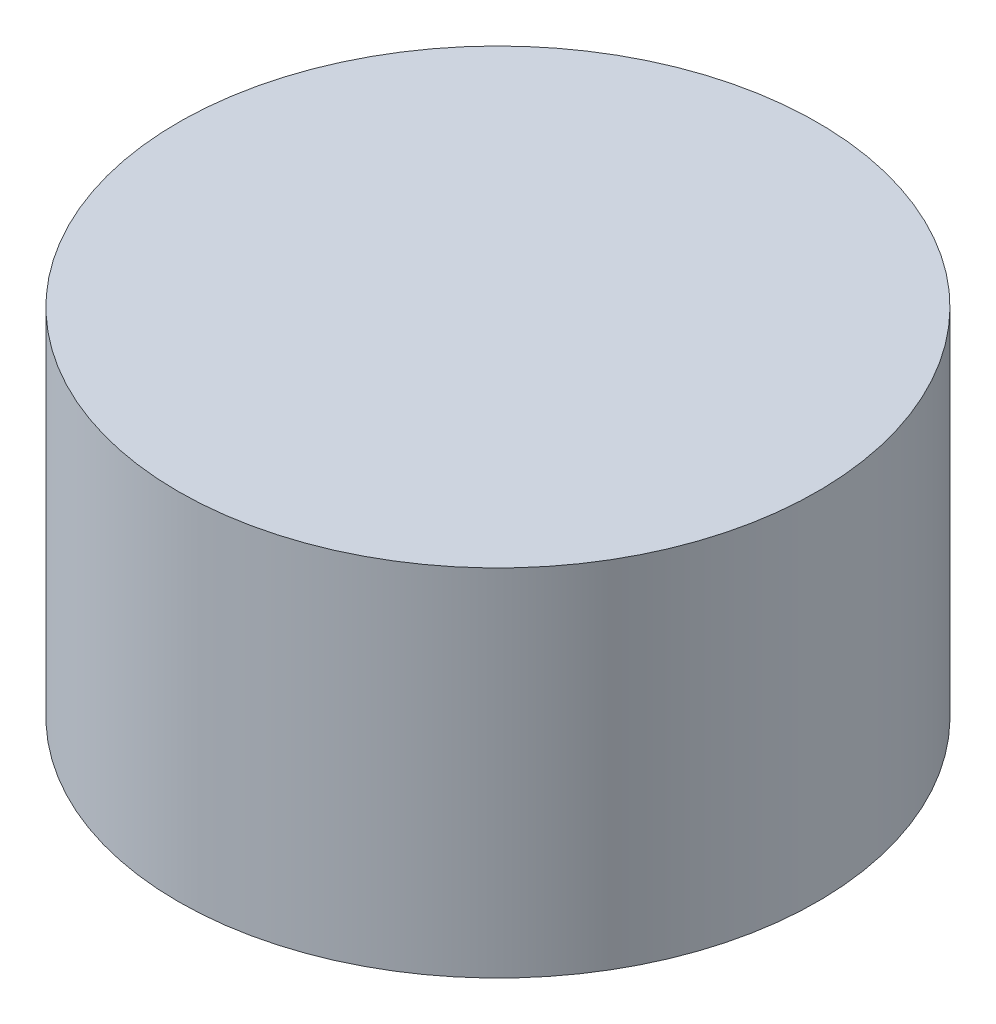
ISO-10303-21;
HEADER;
FILE_DESCRIPTION(('STEP AP214'),'2;1');
FILE_NAME('part.step','',(''),(''),'','','');
FILE_SCHEMA(('AUTOMOTIVE_DESIGN { 1 0 10303 214 1 1 1 1 }'));
ENDSEC;
DATA;
#1=APPLICATION_CONTEXT('core data for automotive mechanical design processes');
#2=APPLICATION_PROTOCOL_DEFINITION('international standard','automotive_design',2000,#1);
#3=PRODUCT_CONTEXT('',#1,'mechanical');
#4=PRODUCT('Part','Part','',(#3));
#5=PRODUCT_RELATED_PRODUCT_CATEGORY('part','',(#4));
#6=PRODUCT_DEFINITION_FORMATION('','',#4);
#7=PRODUCT_DEFINITION_CONTEXT('part definition',#1,'design');
#8=PRODUCT_DEFINITION('design','',#6,#7);
#9=PRODUCT_DEFINITION_SHAPE('','',#8);
#10=(LENGTH_UNIT() NAMED_UNIT(*) SI_UNIT(.MILLI.,.METRE.));
#11=(NAMED_UNIT(*) PLANE_ANGLE_UNIT() SI_UNIT($,.RADIAN.));
#12=(NAMED_UNIT(*) SI_UNIT($,.STERADIAN.) SOLID_ANGLE_UNIT());
#13=UNCERTAINTY_MEASURE_WITH_UNIT(LENGTH_MEASURE(1.E-05),#10,'distance_accuracy_value','');
#14=(GEOMETRIC_REPRESENTATION_CONTEXT(3) GLOBAL_UNCERTAINTY_ASSIGNED_CONTEXT((#13)) GLOBAL_UNIT_ASSIGNED_CONTEXT((#10,
#11,#12)) REPRESENTATION_CONTEXT('',''));
#15=CARTESIAN_POINT('',(0.,0.,0.));
#16=DIRECTION('',(0.,0.,1.));
#17=DIRECTION('',(1.,0.,0.));
#18=AXIS2_PLACEMENT_3D('',#15,#16,#17);
#19=CARTESIAN_POINT('',(0.,15.,0.));
#20=DIRECTION('',(0.,-1.,0.));
#21=DIRECTION('',(0.,0.,-1.));
#22=AXIS2_PLACEMENT_3D('',#19,#20,#21);
#23=CYLINDRICAL_SURFACE('',#22,13.5);
#24=CARTESIAN_POINT('',(0.,15.,0.));
#25=DIRECTION('',(0.,1.,0.));
#26=DIRECTION('',(0.,0.,1.));
#27=AXIS2_PLACEMENT_3D('',#24,#25,#26);
#28=CIRCLE('',#27,13.5);
#29=CARTESIAN_POINT('',(0.,15.,13.5));
#30=VERTEX_POINT('',#29);
#31=EDGE_CURVE('E10',#30,#30,#28,.T.);
#32=ORIENTED_EDGE('',*,*,#31,.F.);
#33=EDGE_LOOP('',(#32));
#34=FACE_BOUND('',#33,.T.);
#35=CARTESIAN_POINT('',(0.,0.,0.));
#36=DIRECTION('',(0.,1.,0.));
#37=DIRECTION('',(0.,0.,1.));
#38=AXIS2_PLACEMENT_3D('',#35,#36,#37);
#39=CIRCLE('',#38,13.5);
#40=CARTESIAN_POINT('',(0.,0.,13.5));
#41=VERTEX_POINT('',#40);
#42=EDGE_CURVE('E33',#41,#41,#39,.T.);
#43=ORIENTED_EDGE('',*,*,#42,.T.);
#44=EDGE_LOOP('',(#43));
#45=FACE_BOUND('',#44,.T.);
#46=ADVANCED_FACE('F30',(#34,#45),#23,.T.);
#47=CARTESIAN_POINT('',(0.,15.,0.));
#48=DIRECTION('',(0.,1.,0.));
#49=DIRECTION('',(0.,0.,1.));
#50=AXIS2_PLACEMENT_3D('',#47,#48,#49);
#51=PLANE('',#50);
#52=ORIENTED_EDGE('',*,*,#31,.T.);
#53=EDGE_LOOP('',(#52));
#54=FACE_BOUND('',#53,.T.);
#55=ADVANCED_FACE('F45',(#54),#51,.T.);
#56=CARTESIAN_POINT('',(0.,0.,0.));
#57=DIRECTION('',(0.,1.,0.));
#58=DIRECTION('',(0.,0.,1.));
#59=AXIS2_PLACEMENT_3D('',#56,#57,#58);
#60=PLANE('',#59);
#61=ORIENTED_EDGE('',*,*,#42,.F.);
#62=EDGE_LOOP('',(#61));
#63=FACE_BOUND('',#62,.T.);
#64=ADVANCED_FACE('F43',(#63),#60,.F.);
#65=CLOSED_SHELL('',(#46,#55,#64));
#66=MANIFOLD_SOLID_BREP('B2',#65);
#67=ADVANCED_BREP_SHAPE_REPRESENTATION('',(#18,#66),#14);
#68=SHAPE_DEFINITION_REPRESENTATION(#9,#67);
ENDSEC;
END-ISO-10303-21;
